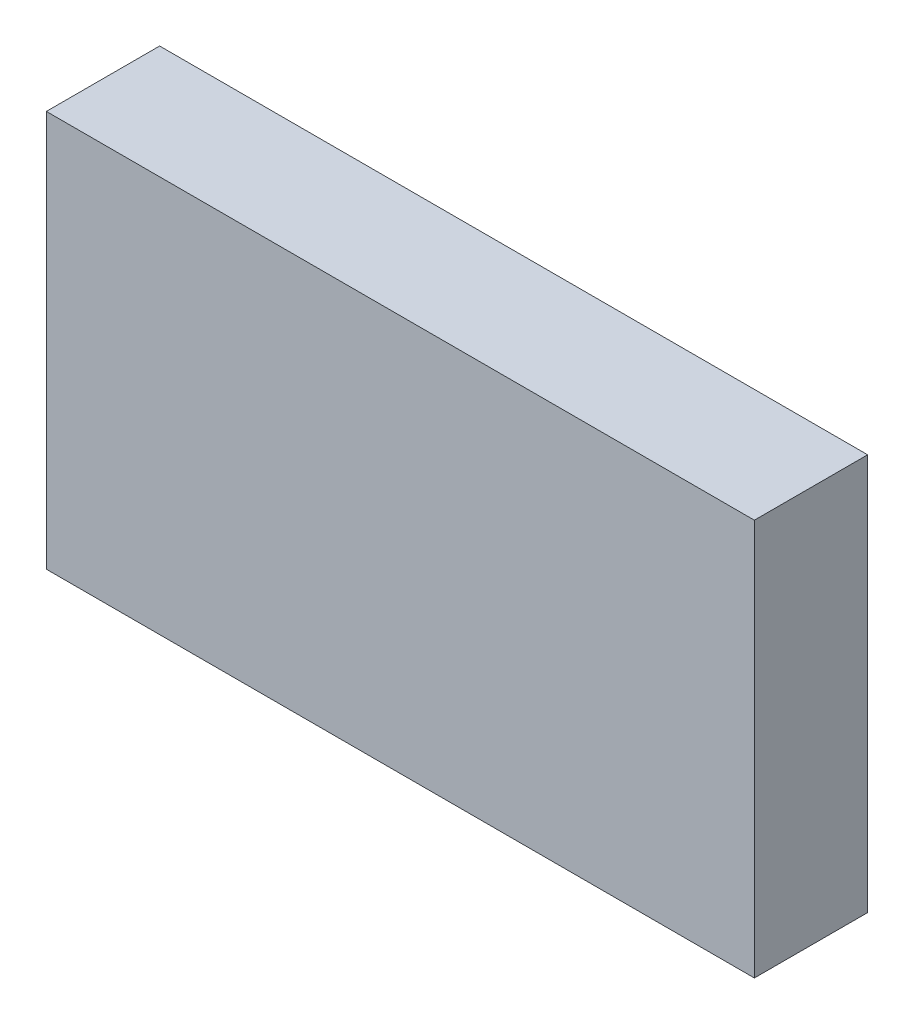
ISO-10303-21;
HEADER;
FILE_DESCRIPTION(('STEP AP214'),'2;1');
FILE_NAME('part.step','',(''),(''),'','','');
FILE_SCHEMA(('AUTOMOTIVE_DESIGN { 1 0 10303 214 1 1 1 1 }'));
ENDSEC;
DATA;
#1=APPLICATION_CONTEXT('core data for automotive mechanical design processes');
#2=APPLICATION_PROTOCOL_DEFINITION('international standard','automotive_design',2000,#1);
#3=PRODUCT_CONTEXT('',#1,'mechanical');
#4=PRODUCT('Part','Part','',(#3));
#5=PRODUCT_RELATED_PRODUCT_CATEGORY('part','',(#4));
#6=PRODUCT_DEFINITION_FORMATION('','',#4);
#7=PRODUCT_DEFINITION_CONTEXT('part definition',#1,'design');
#8=PRODUCT_DEFINITION('design','',#6,#7);
#9=PRODUCT_DEFINITION_SHAPE('','',#8);
#10=(LENGTH_UNIT() NAMED_UNIT(*) SI_UNIT(.MILLI.,.METRE.));
#11=(NAMED_UNIT(*) PLANE_ANGLE_UNIT() SI_UNIT($,.RADIAN.));
#12=(NAMED_UNIT(*) SI_UNIT($,.STERADIAN.) SOLID_ANGLE_UNIT());
#13=UNCERTAINTY_MEASURE_WITH_UNIT(LENGTH_MEASURE(1.E-05),#10,'distance_accuracy_value','');
#14=(GEOMETRIC_REPRESENTATION_CONTEXT(3) GLOBAL_UNCERTAINTY_ASSIGNED_CONTEXT((#13)) GLOBAL_UNIT_ASSIGNED_CONTEXT((#10,
#11,#12)) REPRESENTATION_CONTEXT('',''));
#15=CARTESIAN_POINT('',(0.,0.,0.));
#16=DIRECTION('',(0.,0.,1.));
#17=DIRECTION('',(1.,0.,0.));
#18=AXIS2_PLACEMENT_3D('',#15,#16,#17);
#19=CARTESIAN_POINT('',(0.,0.,2.));
#20=DIRECTION('',(1.,0.,0.));
#21=DIRECTION('',(0.,1.,0.));
#22=AXIS2_PLACEMENT_3D('',#19,#20,#21);
#23=PLANE('',#22);
#24=DIRECTION('',(0.,-1.,0.));
#25=VECTOR('',#24,1.);
#26=CARTESIAN_POINT('',(0.,0.,0.));
#27=LINE('',#26,#25);
#28=CARTESIAN_POINT('',(0.,7.,0.));
#29=VERTEX_POINT('',#28);
#30=CARTESIAN_POINT('',(0.,0.,0.));
#31=VERTEX_POINT('',#30);
#32=EDGE_CURVE('E100',#29,#31,#27,.T.);
#33=ORIENTED_EDGE('',*,*,#32,.T.);
#34=DIRECTION('',(0.,0.,-1.));
#35=VECTOR('',#34,1.);
#36=CARTESIAN_POINT('',(0.,0.,2.));
#37=LINE('',#36,#35);
#38=CARTESIAN_POINT('',(0.,0.,2.));
#39=VERTEX_POINT('',#38);
#40=EDGE_CURVE('E11',#39,#31,#37,.T.);
#41=ORIENTED_EDGE('',*,*,#40,.F.);
#42=DIRECTION('',(0.,-1.,0.));
#43=VECTOR('',#42,1.);
#44=CARTESIAN_POINT('',(0.,0.,2.));
#45=LINE('',#44,#43);
#46=CARTESIAN_POINT('',(0.,7.,2.));
#47=VERTEX_POINT('',#46);
#48=EDGE_CURVE('E88',#47,#39,#45,.T.);
#49=ORIENTED_EDGE('',*,*,#48,.F.);
#50=DIRECTION('',(0.,0.,-1.));
#51=VECTOR('',#50,1.);
#52=CARTESIAN_POINT('',(0.,7.,2.));
#53=LINE('',#52,#51);
#54=EDGE_CURVE('E96',#47,#29,#53,.T.);
#55=ORIENTED_EDGE('',*,*,#54,.T.);
#56=EDGE_LOOP('',(#33,#41,#49,#55));
#57=FACE_BOUND('',#56,.T.);
#58=ADVANCED_FACE('F37',(#57),#23,.F.);
#59=CARTESIAN_POINT('',(0.,0.,2.));
#60=DIRECTION('',(0.,1.,0.));
#61=DIRECTION('',(0.,0.,1.));
#62=AXIS2_PLACEMENT_3D('',#59,#60,#61);
#63=PLANE('',#62);
#64=DIRECTION('',(1.,0.,0.));
#65=VECTOR('',#64,1.);
#66=CARTESIAN_POINT('',(0.,0.,0.));
#67=LINE('',#66,#65);
#68=CARTESIAN_POINT('',(12.5,0.,0.));
#69=VERTEX_POINT('',#68);
#70=EDGE_CURVE('E92',#31,#69,#67,.T.);
#71=ORIENTED_EDGE('',*,*,#70,.T.);
#72=DIRECTION('',(0.,0.,-1.));
#73=VECTOR('',#72,1.);
#74=CARTESIAN_POINT('',(12.5,0.,2.));
#75=LINE('',#74,#73);
#76=CARTESIAN_POINT('',(12.5,0.,2.));
#77=VERTEX_POINT('',#76);
#78=EDGE_CURVE('E45',#77,#69,#75,.T.);
#79=ORIENTED_EDGE('',*,*,#78,.F.);
#80=DIRECTION('',(1.,0.,0.));
#81=VECTOR('',#80,1.);
#82=CARTESIAN_POINT('',(0.,0.,2.));
#83=LINE('',#82,#81);
#84=EDGE_CURVE('E83',#39,#77,#83,.T.);
#85=ORIENTED_EDGE('',*,*,#84,.F.);
#86=ORIENTED_EDGE('',*,*,#40,.T.);
#87=EDGE_LOOP('',(#71,#79,#85,#86));
#88=FACE_BOUND('',#87,.T.);
#89=ADVANCED_FACE('F91',(#88),#63,.F.);
#90=CARTESIAN_POINT('',(12.5,0.,2.));
#91=DIRECTION('',(-1.,0.,0.));
#92=DIRECTION('',(0.,-1.,0.));
#93=AXIS2_PLACEMENT_3D('',#90,#91,#92);
#94=PLANE('',#93);
#95=DIRECTION('',(0.,1.,0.));
#96=VECTOR('',#95,1.);
#97=CARTESIAN_POINT('',(12.5,0.,0.));
#98=LINE('',#97,#96);
#99=CARTESIAN_POINT('',(12.5,7.,0.));
#100=VERTEX_POINT('',#99);
#101=EDGE_CURVE('E70',#69,#100,#98,.T.);
#102=ORIENTED_EDGE('',*,*,#101,.T.);
#103=DIRECTION('',(0.,0.,-1.));
#104=VECTOR('',#103,1.);
#105=CARTESIAN_POINT('',(12.5,7.,2.));
#106=LINE('',#105,#104);
#107=CARTESIAN_POINT('',(12.5,7.,2.));
#108=VERTEX_POINT('',#107);
#109=EDGE_CURVE('E93',#108,#100,#106,.T.);
#110=ORIENTED_EDGE('',*,*,#109,.F.);
#111=DIRECTION('',(0.,1.,0.));
#112=VECTOR('',#111,1.);
#113=CARTESIAN_POINT('',(12.5,0.,2.));
#114=LINE('',#113,#112);
#115=EDGE_CURVE('E86',#77,#108,#114,.T.);
#116=ORIENTED_EDGE('',*,*,#115,.F.);
#117=ORIENTED_EDGE('',*,*,#78,.T.);
#118=EDGE_LOOP('',(#102,#110,#116,#117));
#119=FACE_BOUND('',#118,.T.);
#120=ADVANCED_FACE('F94',(#119),#94,.F.);
#121=CARTESIAN_POINT('',(0.,7.,2.));
#122=DIRECTION('',(0.,-1.,0.));
#123=DIRECTION('',(0.,0.,-1.));
#124=AXIS2_PLACEMENT_3D('',#121,#122,#123);
#125=PLANE('',#124);
#126=DIRECTION('',(-1.,0.,0.));
#127=VECTOR('',#126,1.);
#128=CARTESIAN_POINT('',(0.,7.,0.));
#129=LINE('',#128,#127);
#130=EDGE_CURVE('E76',#100,#29,#129,.T.);
#131=ORIENTED_EDGE('',*,*,#130,.T.);
#132=ORIENTED_EDGE('',*,*,#54,.F.);
#133=DIRECTION('',(-1.,0.,0.));
#134=VECTOR('',#133,1.);
#135=CARTESIAN_POINT('',(0.,7.,2.));
#136=LINE('',#135,#134);
#137=EDGE_CURVE('E53',#108,#47,#136,.T.);
#138=ORIENTED_EDGE('',*,*,#137,.F.);
#139=ORIENTED_EDGE('',*,*,#109,.T.);
#140=EDGE_LOOP('',(#131,#132,#138,#139));
#141=FACE_BOUND('',#140,.T.);
#142=ADVANCED_FACE('F107',(#141),#125,.F.);
#143=CARTESIAN_POINT('',(0.,0.,2.));
#144=DIRECTION('',(0.,0.,-1.));
#145=DIRECTION('',(-1.,0.,0.));
#146=AXIS2_PLACEMENT_3D('',#143,#144,#145);
#147=PLANE('',#146);
#148=ORIENTED_EDGE('',*,*,#48,.T.);
#149=ORIENTED_EDGE('',*,*,#84,.T.);
#150=ORIENTED_EDGE('',*,*,#115,.T.);
#151=ORIENTED_EDGE('',*,*,#137,.T.);
#152=EDGE_LOOP('',(#148,#149,#150,#151));
#153=FACE_BOUND('',#152,.T.);
#154=ADVANCED_FACE('F84',(#153),#147,.F.);
#155=CARTESIAN_POINT('',(0.,0.,0.));
#156=DIRECTION('',(0.,0.,-1.));
#157=DIRECTION('',(-1.,0.,0.));
#158=AXIS2_PLACEMENT_3D('',#155,#156,#157);
#159=PLANE('',#158);
#160=ORIENTED_EDGE('',*,*,#32,.F.);
#161=ORIENTED_EDGE('',*,*,#130,.F.);
#162=ORIENTED_EDGE('',*,*,#101,.F.);
#163=ORIENTED_EDGE('',*,*,#70,.F.);
#164=EDGE_LOOP('',(#160,#161,#162,#163));
#165=FACE_BOUND('',#164,.T.);
#166=ADVANCED_FACE('F110',(#165),#159,.T.);
#167=CLOSED_SHELL('',(#58,#89,#120,#142,#154,#166));
#168=MANIFOLD_SOLID_BREP('B2',#167);
#169=ADVANCED_BREP_SHAPE_REPRESENTATION('',(#18,#168),#14);
#170=SHAPE_DEFINITION_REPRESENTATION(#9,#169);
ENDSEC;
END-ISO-10303-21;
